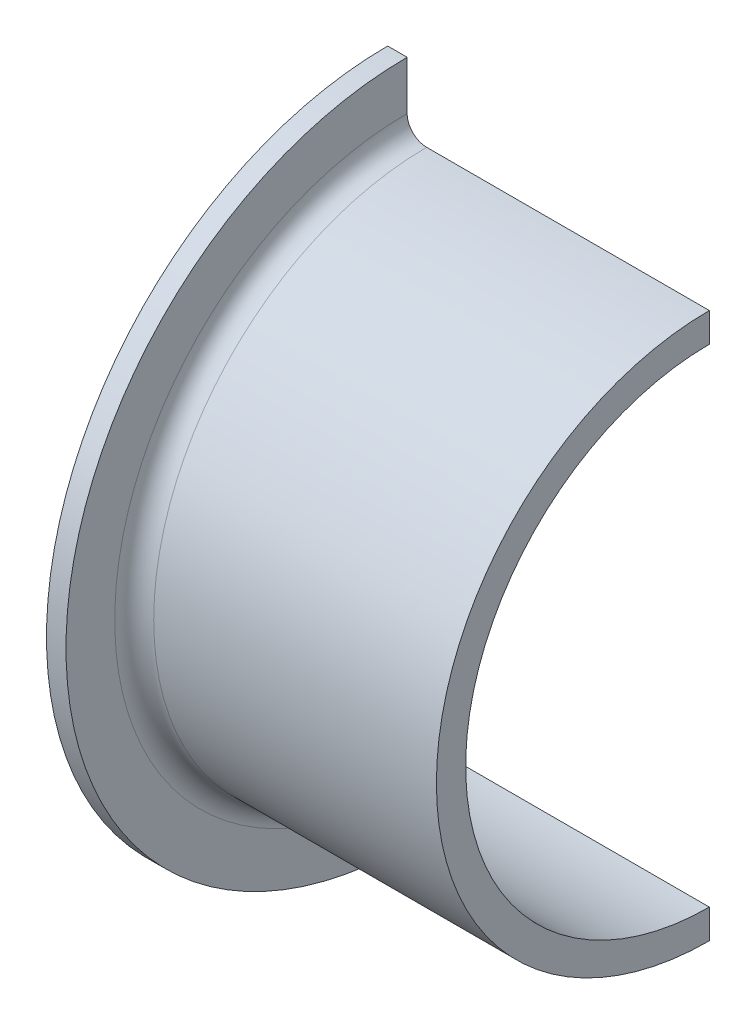
ISO-10303-21;
HEADER;
FILE_DESCRIPTION(('STEP AP214'),'2;1');
FILE_NAME('part.step','',(''),(''),'','','');
FILE_SCHEMA(('AUTOMOTIVE_DESIGN { 1 0 10303 214 1 1 1 1 }'));
ENDSEC;
DATA;
#1=APPLICATION_CONTEXT('core data for automotive mechanical design processes');
#2=APPLICATION_PROTOCOL_DEFINITION('international standard','automotive_design',2000,#1);
#3=PRODUCT_CONTEXT('',#1,'mechanical');
#4=PRODUCT('Part','Part','',(#3));
#5=PRODUCT_RELATED_PRODUCT_CATEGORY('part','',(#4));
#6=PRODUCT_DEFINITION_FORMATION('','',#4);
#7=PRODUCT_DEFINITION_CONTEXT('part definition',#1,'design');
#8=PRODUCT_DEFINITION('design','',#6,#7);
#9=PRODUCT_DEFINITION_SHAPE('','',#8);
#10=(LENGTH_UNIT() NAMED_UNIT(*) SI_UNIT(.MILLI.,.METRE.));
#11=(NAMED_UNIT(*) PLANE_ANGLE_UNIT() SI_UNIT($,.RADIAN.));
#12=(NAMED_UNIT(*) SI_UNIT($,.STERADIAN.) SOLID_ANGLE_UNIT());
#13=UNCERTAINTY_MEASURE_WITH_UNIT(LENGTH_MEASURE(1.E-05),#10,'distance_accuracy_value','');
#14=(GEOMETRIC_REPRESENTATION_CONTEXT(3) GLOBAL_UNCERTAINTY_ASSIGNED_CONTEXT((#13)) GLOBAL_UNIT_ASSIGNED_CONTEXT((#10,
#11,#12)) REPRESENTATION_CONTEXT('',''));
#15=CARTESIAN_POINT('',(0.,0.,0.));
#16=DIRECTION('',(0.,0.,1.));
#17=DIRECTION('',(1.,0.,0.));
#18=AXIS2_PLACEMENT_3D('',#15,#16,#17);
#19=CARTESIAN_POINT('',(16.5,-14.,0.));
#20=DIRECTION('',(-1.,0.,0.));
#21=DIRECTION('',(0.,0.,1.));
#22=AXIS2_PLACEMENT_3D('',#19,#20,#21);
#23=PLANE('',#22);
#24=CARTESIAN_POINT('',(16.5,0.,0.));
#25=DIRECTION('',(-1.,0.,0.));
#26=DIRECTION('',(0.,0.,1.));
#27=AXIS2_PLACEMENT_3D('',#24,#25,#26);
#28=CIRCLE('',#27,12.5);
#29=CARTESIAN_POINT('',(16.5,-12.5,0.));
#30=VERTEX_POINT('',#29);
#31=CARTESIAN_POINT('',(16.5,12.5,0.));
#32=VERTEX_POINT('',#31);
#33=EDGE_CURVE('E11',#30,#32,#28,.T.);
#34=ORIENTED_EDGE('',*,*,#33,.T.);
#35=DIRECTION('',(0.,1.,0.));
#36=VECTOR('',#35,1.);
#37=CARTESIAN_POINT('',(16.5,14.,0.));
#38=LINE('',#37,#36);
#39=CARTESIAN_POINT('',(16.5,14.,0.));
#40=VERTEX_POINT('',#39);
#41=EDGE_CURVE('E116',#32,#40,#38,.T.);
#42=ORIENTED_EDGE('',*,*,#41,.T.);
#43=CARTESIAN_POINT('',(16.5,0.,0.));
#44=DIRECTION('',(-1.,0.,0.));
#45=DIRECTION('',(0.,0.,1.));
#46=AXIS2_PLACEMENT_3D('',#43,#44,#45);
#47=CIRCLE('',#46,14.);
#48=CARTESIAN_POINT('',(16.5,-14.,0.));
#49=VERTEX_POINT('',#48);
#50=EDGE_CURVE('E98',#49,#40,#47,.T.);
#51=ORIENTED_EDGE('',*,*,#50,.F.);
#52=DIRECTION('',(0.,-1.,0.));
#53=VECTOR('',#52,1.);
#54=CARTESIAN_POINT('',(16.5,-14.,0.));
#55=LINE('',#54,#53);
#56=EDGE_CURVE('E137',#30,#49,#55,.T.);
#57=ORIENTED_EDGE('',*,*,#56,.F.);
#58=EDGE_LOOP('',(#34,#42,#51,#57));
#59=FACE_BOUND('',#58,.T.);
#60=ADVANCED_FACE('F34',(#59),#23,.F.);
#61=CARTESIAN_POINT('',(0.,0.,0.));
#62=DIRECTION('',(-1.,0.,0.));
#63=DIRECTION('',(0.,0.,1.));
#64=AXIS2_PLACEMENT_3D('',#61,#62,#63);
#65=CYLINDRICAL_SURFACE('',#64,12.5);
#66=CARTESIAN_POINT('',(1.,0.,0.));
#67=DIRECTION('',(-1.,0.,0.));
#68=DIRECTION('',(0.,0.,1.));
#69=AXIS2_PLACEMENT_3D('',#66,#67,#68);
#70=CIRCLE('',#69,12.5);
#71=CARTESIAN_POINT('',(1.,-12.5,0.));
#72=VERTEX_POINT('',#71);
#73=CARTESIAN_POINT('',(1.,12.5,0.));
#74=VERTEX_POINT('',#73);
#75=EDGE_CURVE('E42',#72,#74,#70,.T.);
#76=ORIENTED_EDGE('',*,*,#75,.T.);
#77=DIRECTION('',(1.,0.,0.));
#78=VECTOR('',#77,1.);
#79=CARTESIAN_POINT('',(16.5,12.5,0.));
#80=LINE('',#79,#78);
#81=EDGE_CURVE('E135',#74,#32,#80,.T.);
#82=ORIENTED_EDGE('',*,*,#81,.T.);
#83=ORIENTED_EDGE('',*,*,#33,.F.);
#84=DIRECTION('',(1.,0.,0.));
#85=VECTOR('',#84,1.);
#86=CARTESIAN_POINT('',(16.5,-12.5,0.));
#87=LINE('',#86,#85);
#88=EDGE_CURVE('E110',#72,#30,#87,.T.);
#89=ORIENTED_EDGE('',*,*,#88,.F.);
#90=EDGE_LOOP('',(#76,#82,#83,#89));
#91=FACE_BOUND('',#90,.T.);
#92=ADVANCED_FACE('F36',(#91),#65,.F.);
#93=CARTESIAN_POINT('',(1.,0.,0.));
#94=DIRECTION('',(-1.,0.,0.));
#95=DIRECTION('',(0.,0.,1.));
#96=AXIS2_PLACEMENT_3D('',#93,#94,#95);
#97=TOROIDAL_SURFACE('',#96,13.5,1.);
#98=CARTESIAN_POINT('',(0.,0.,0.));
#99=DIRECTION('',(-1.,0.,0.));
#100=DIRECTION('',(0.,0.,1.));
#101=AXIS2_PLACEMENT_3D('',#98,#99,#100);
#102=CIRCLE('',#101,13.5);
#103=CARTESIAN_POINT('',(0.,-13.5,0.));
#104=VERTEX_POINT('',#103);
#105=CARTESIAN_POINT('',(0.,13.5,0.));
#106=VERTEX_POINT('',#105);
#107=EDGE_CURVE('E162',#104,#106,#102,.T.);
#108=ORIENTED_EDGE('',*,*,#107,.T.);
#109=CARTESIAN_POINT('',(1.,13.5,0.));
#110=DIRECTION('',(0.,0.,1.));
#111=DIRECTION('',(-1.,0.,0.));
#112=AXIS2_PLACEMENT_3D('',#109,#110,#111);
#113=CIRCLE('',#112,1.);
#114=EDGE_CURVE('E133',#106,#74,#113,.T.);
#115=ORIENTED_EDGE('',*,*,#114,.T.);
#116=ORIENTED_EDGE('',*,*,#75,.F.);
#117=CARTESIAN_POINT('',(1.,-13.5,0.));
#118=DIRECTION('',(0.,0.,-1.));
#119=DIRECTION('',(-1.,0.,0.));
#120=AXIS2_PLACEMENT_3D('',#117,#118,#119);
#121=CIRCLE('',#120,1.);
#122=EDGE_CURVE('E152',#104,#72,#121,.T.);
#123=ORIENTED_EDGE('',*,*,#122,.F.);
#124=EDGE_LOOP('',(#108,#115,#116,#123));
#125=FACE_BOUND('',#124,.T.);
#126=ADVANCED_FACE('F164',(#125),#97,.T.);
#127=CARTESIAN_POINT('',(0.,-13.5,0.));
#128=DIRECTION('',(1.,0.,0.));
#129=DIRECTION('',(0.,0.,-1.));
#130=AXIS2_PLACEMENT_3D('',#127,#128,#129);
#131=PLANE('',#130);
#132=CARTESIAN_POINT('',(0.,0.,0.));
#133=DIRECTION('',(-1.,0.,0.));
#134=DIRECTION('',(0.,0.,1.));
#135=AXIS2_PLACEMENT_3D('',#132,#133,#134);
#136=CIRCLE('',#135,17.5);
#137=CARTESIAN_POINT('',(0.,-17.5,-1.2220184685951E-13));
#138=VERTEX_POINT('',#137);
#139=CARTESIAN_POINT('',(0.,17.5,0.));
#140=VERTEX_POINT('',#139);
#141=EDGE_CURVE('E160',#138,#140,#136,.T.);
#142=ORIENTED_EDGE('',*,*,#141,.T.);
#143=DIRECTION('',(0.,-1.,0.));
#144=VECTOR('',#143,1.);
#145=CARTESIAN_POINT('',(0.,13.5,0.));
#146=LINE('',#145,#144);
#147=EDGE_CURVE('E130',#140,#106,#146,.T.);
#148=ORIENTED_EDGE('',*,*,#147,.T.);
#149=ORIENTED_EDGE('',*,*,#107,.F.);
#150=DIRECTION('',(0.,1.,0.));
#151=VECTOR('',#150,1.);
#152=CARTESIAN_POINT('',(0.,-13.5,0.));
#153=LINE('',#152,#151);
#154=EDGE_CURVE('E149',#138,#104,#153,.T.);
#155=ORIENTED_EDGE('',*,*,#154,.F.);
#156=EDGE_LOOP('',(#142,#148,#149,#155));
#157=FACE_BOUND('',#156,.T.);
#158=ADVANCED_FACE('F168',(#157),#131,.F.);
#159=CARTESIAN_POINT('',(0.,0.,0.));
#160=DIRECTION('',(-1.,0.,0.));
#161=DIRECTION('',(0.,0.,1.));
#162=AXIS2_PLACEMENT_3D('',#159,#160,#161);
#163=CYLINDRICAL_SURFACE('',#162,17.5);
#164=CARTESIAN_POINT('',(1.,0.,0.));
#165=DIRECTION('',(-1.,0.,0.));
#166=DIRECTION('',(0.,0.,1.));
#167=AXIS2_PLACEMENT_3D('',#164,#165,#166);
#168=CIRCLE('',#167,17.5);
#169=CARTESIAN_POINT('',(1.,-17.5,-1.2220184685951E-13));
#170=VERTEX_POINT('',#169);
#171=CARTESIAN_POINT('',(1.,17.5,0.));
#172=VERTEX_POINT('',#171);
#173=EDGE_CURVE('E158',#170,#172,#168,.T.);
#174=ORIENTED_EDGE('',*,*,#173,.T.);
#175=DIRECTION('',(-1.,0.,0.));
#176=VECTOR('',#175,1.);
#177=CARTESIAN_POINT('',(0.,17.5,0.));
#178=LINE('',#177,#176);
#179=EDGE_CURVE('E127',#172,#140,#178,.T.);
#180=ORIENTED_EDGE('',*,*,#179,.T.);
#181=ORIENTED_EDGE('',*,*,#141,.F.);
#182=DIRECTION('',(-1.,0.,0.));
#183=VECTOR('',#182,1.);
#184=CARTESIAN_POINT('',(0.,-17.5,-1.2220184685951E-13));
#185=LINE('',#184,#183);
#186=EDGE_CURVE('E146',#170,#138,#185,.T.);
#187=ORIENTED_EDGE('',*,*,#186,.F.);
#188=EDGE_LOOP('',(#174,#180,#181,#187));
#189=FACE_BOUND('',#188,.T.);
#190=ADVANCED_FACE('F172',(#189),#163,.T.);
#191=CARTESIAN_POINT('',(1.,-17.5,-1.2220184685951E-13));
#192=DIRECTION('',(-1.,0.,0.));
#193=DIRECTION('',(0.,0.,1.));
#194=AXIS2_PLACEMENT_3D('',#191,#192,#193);
#195=PLANE('',#194);
#196=CARTESIAN_POINT('',(1.,0.,0.));
#197=DIRECTION('',(-1.,0.,0.));
#198=DIRECTION('',(0.,0.,1.));
#199=AXIS2_PLACEMENT_3D('',#196,#197,#198);
#200=CIRCLE('',#199,15.);
#201=CARTESIAN_POINT('',(1.,-15.,-1.04744440165294E-13));
#202=VERTEX_POINT('',#201);
#203=CARTESIAN_POINT('',(1.,15.,0.));
#204=VERTEX_POINT('',#203);
#205=EDGE_CURVE('E156',#202,#204,#200,.T.);
#206=ORIENTED_EDGE('',*,*,#205,.T.);
#207=DIRECTION('',(0.,1.,0.));
#208=VECTOR('',#207,1.);
#209=CARTESIAN_POINT('',(1.,17.5,0.));
#210=LINE('',#209,#208);
#211=EDGE_CURVE('E124',#204,#172,#210,.T.);
#212=ORIENTED_EDGE('',*,*,#211,.T.);
#213=ORIENTED_EDGE('',*,*,#173,.F.);
#214=DIRECTION('',(0.,-1.,0.));
#215=VECTOR('',#214,1.);
#216=CARTESIAN_POINT('',(1.,-17.5,-1.2220184685951E-13));
#217=LINE('',#216,#215);
#218=EDGE_CURVE('E143',#202,#170,#217,.T.);
#219=ORIENTED_EDGE('',*,*,#218,.F.);
#220=EDGE_LOOP('',(#206,#212,#213,#219));
#221=FACE_BOUND('',#220,.T.);
#222=ADVANCED_FACE('F175',(#221),#195,.F.);
#223=CARTESIAN_POINT('',(2.,0.,0.));
#224=DIRECTION('',(-1.,0.,0.));
#225=DIRECTION('',(0.,0.,1.));
#226=AXIS2_PLACEMENT_3D('',#223,#224,#225);
#227=TOROIDAL_SURFACE('',#226,15.,1.);
#228=CARTESIAN_POINT('',(2.,0.,0.));
#229=DIRECTION('',(-1.,0.,0.));
#230=DIRECTION('',(0.,0.,1.));
#231=AXIS2_PLACEMENT_3D('',#228,#229,#230);
#232=CIRCLE('',#231,14.);
#233=CARTESIAN_POINT('',(2.,-14.,0.));
#234=VERTEX_POINT('',#233);
#235=CARTESIAN_POINT('',(2.,14.,0.));
#236=VERTEX_POINT('',#235);
#237=EDGE_CURVE('E109',#234,#236,#232,.T.);
#238=ORIENTED_EDGE('',*,*,#237,.T.);
#239=CARTESIAN_POINT('',(2.,15.,0.));
#240=DIRECTION('',(0.,0.,-1.));
#241=DIRECTION('',(1.,0.,0.));
#242=AXIS2_PLACEMENT_3D('',#239,#240,#241);
#243=CIRCLE('',#242,1.);
#244=EDGE_CURVE('E119',#236,#204,#243,.T.);
#245=ORIENTED_EDGE('',*,*,#244,.T.);
#246=ORIENTED_EDGE('',*,*,#205,.F.);
#247=CARTESIAN_POINT('',(2.,-15.,-1.04744440165294E-13));
#248=DIRECTION('',(0.,0.,1.));
#249=DIRECTION('',(1.,0.,0.));
#250=AXIS2_PLACEMENT_3D('',#247,#248,#249);
#251=CIRCLE('',#250,1.);
#252=EDGE_CURVE('E140',#234,#202,#251,.T.);
#253=ORIENTED_EDGE('',*,*,#252,.F.);
#254=EDGE_LOOP('',(#238,#245,#246,#253));
#255=FACE_BOUND('',#254,.T.);
#256=ADVANCED_FACE('F178',(#255),#227,.F.);
#257=CARTESIAN_POINT('',(0.,0.,0.));
#258=DIRECTION('',(-1.,0.,0.));
#259=DIRECTION('',(0.,0.,1.));
#260=AXIS2_PLACEMENT_3D('',#257,#258,#259);
#261=CYLINDRICAL_SURFACE('',#260,14.);
#262=DIRECTION('',(-1.,0.,0.));
#263=VECTOR('',#262,1.);
#264=CARTESIAN_POINT('',(2.,-14.,0.));
#265=LINE('',#264,#263);
#266=EDGE_CURVE('E104',#49,#234,#265,.T.);
#267=ORIENTED_EDGE('',*,*,#266,.F.);
#268=ORIENTED_EDGE('',*,*,#50,.T.);
#269=DIRECTION('',(-1.,0.,0.));
#270=VECTOR('',#269,1.);
#271=CARTESIAN_POINT('',(2.,14.,0.));
#272=LINE('',#271,#270);
#273=EDGE_CURVE('E101',#40,#236,#272,.T.);
#274=ORIENTED_EDGE('',*,*,#273,.T.);
#275=ORIENTED_EDGE('',*,*,#237,.F.);
#276=EDGE_LOOP('',(#267,#268,#274,#275));
#277=FACE_BOUND('',#276,.T.);
#278=ADVANCED_FACE('F100',(#277),#261,.T.);
#279=CARTESIAN_POINT('',(1.,-13.5,0.));
#280=DIRECTION('',(0.,0.,1.));
#281=DIRECTION('',(-1.,0.,0.));
#282=AXIS2_PLACEMENT_3D('',#279,#280,#281);
#283=PLANE('',#282);
#284=ORIENTED_EDGE('',*,*,#56,.T.);
#285=ORIENTED_EDGE('',*,*,#266,.T.);
#286=ORIENTED_EDGE('',*,*,#252,.T.);
#287=ORIENTED_EDGE('',*,*,#218,.T.);
#288=ORIENTED_EDGE('',*,*,#186,.T.);
#289=ORIENTED_EDGE('',*,*,#154,.T.);
#290=ORIENTED_EDGE('',*,*,#122,.T.);
#291=ORIENTED_EDGE('',*,*,#88,.T.);
#292=EDGE_LOOP('',(#284,#285,#286,#287,#288,#289,#290,#291));
#293=FACE_BOUND('',#292,.T.);
#294=ADVANCED_FACE('F180',(#293),#283,.F.);
#295=CARTESIAN_POINT('',(1.,13.5,0.));
#296=DIRECTION('',(0.,0.,-1.));
#297=DIRECTION('',(-1.,0.,0.));
#298=AXIS2_PLACEMENT_3D('',#295,#296,#297);
#299=PLANE('',#298);
#300=ORIENTED_EDGE('',*,*,#41,.F.);
#301=ORIENTED_EDGE('',*,*,#81,.F.);
#302=ORIENTED_EDGE('',*,*,#114,.F.);
#303=ORIENTED_EDGE('',*,*,#147,.F.);
#304=ORIENTED_EDGE('',*,*,#179,.F.);
#305=ORIENTED_EDGE('',*,*,#211,.F.);
#306=ORIENTED_EDGE('',*,*,#244,.F.);
#307=ORIENTED_EDGE('',*,*,#273,.F.);
#308=EDGE_LOOP('',(#300,#301,#302,#303,#304,#305,#306,#307));
#309=FACE_BOUND('',#308,.T.);
#310=ADVANCED_FACE('F114',(#309),#299,.T.);
#311=CLOSED_SHELL('',(#60,#92,#126,#158,#190,#222,#256,#278,#294,#310));
#312=MANIFOLD_SOLID_BREP('B2',#311);
#313=ADVANCED_BREP_SHAPE_REPRESENTATION('',(#18,#312),#14);
#314=SHAPE_DEFINITION_REPRESENTATION(#9,#313);
ENDSEC;
END-ISO-10303-21;
